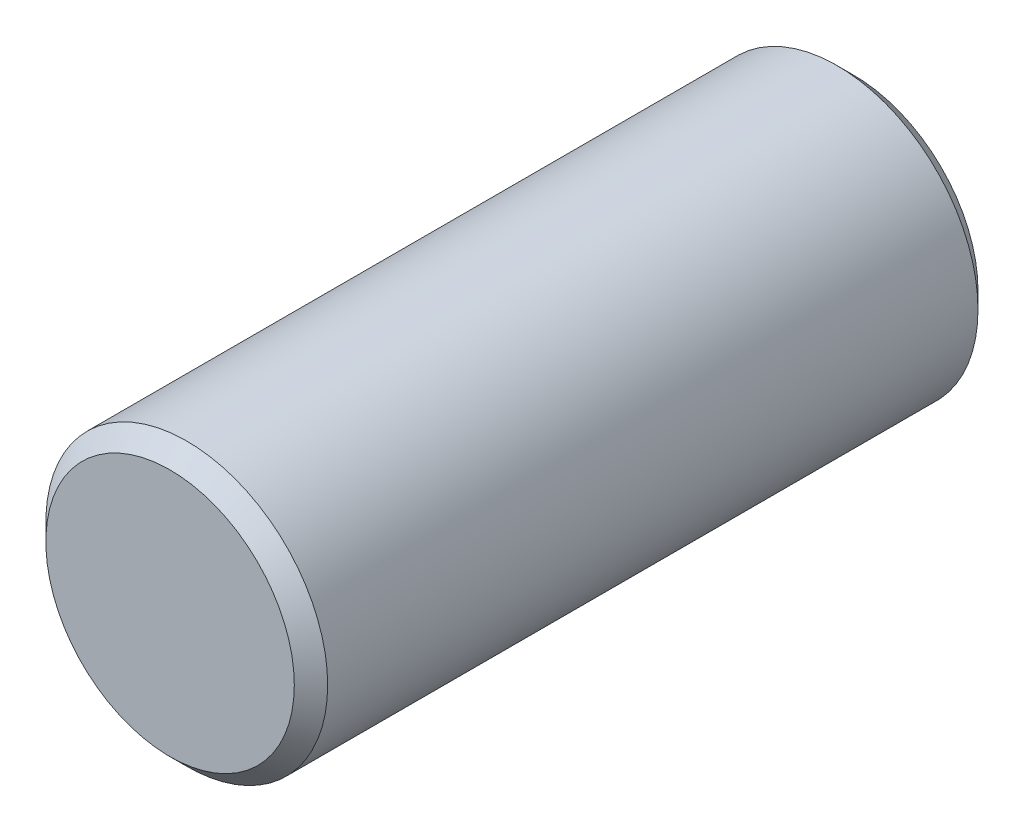
ISO-10303-21;
HEADER;
FILE_DESCRIPTION(('STEP AP214'),'2;1');
FILE_NAME('part.step','',(''),(''),'','','');
FILE_SCHEMA(('AUTOMOTIVE_DESIGN { 1 0 10303 214 1 1 1 1 }'));
ENDSEC;
DATA;
#1=APPLICATION_CONTEXT('core data for automotive mechanical design processes');
#2=APPLICATION_PROTOCOL_DEFINITION('international standard','automotive_design',2000,#1);
#3=PRODUCT_CONTEXT('',#1,'mechanical');
#4=PRODUCT('Part','Part','',(#3));
#5=PRODUCT_RELATED_PRODUCT_CATEGORY('part','',(#4));
#6=PRODUCT_DEFINITION_FORMATION('','',#4);
#7=PRODUCT_DEFINITION_CONTEXT('part definition',#1,'design');
#8=PRODUCT_DEFINITION('design','',#6,#7);
#9=PRODUCT_DEFINITION_SHAPE('','',#8);
#10=(LENGTH_UNIT() NAMED_UNIT(*) SI_UNIT(.MILLI.,.METRE.));
#11=(NAMED_UNIT(*) PLANE_ANGLE_UNIT() SI_UNIT($,.RADIAN.));
#12=(NAMED_UNIT(*) SI_UNIT($,.STERADIAN.) SOLID_ANGLE_UNIT());
#13=UNCERTAINTY_MEASURE_WITH_UNIT(LENGTH_MEASURE(1.E-05),#10,'distance_accuracy_value','');
#14=(GEOMETRIC_REPRESENTATION_CONTEXT(3) GLOBAL_UNCERTAINTY_ASSIGNED_CONTEXT((#13)) GLOBAL_UNIT_ASSIGNED_CONTEXT((#10,
#11,#12)) REPRESENTATION_CONTEXT('',''));
#15=CARTESIAN_POINT('',(0.,0.,0.));
#16=DIRECTION('',(0.,0.,1.));
#17=DIRECTION('',(1.,0.,0.));
#18=AXIS2_PLACEMENT_3D('',#15,#16,#17);
#19=CARTESIAN_POINT('',(0.,0.,1041.4));
#20=DIRECTION('',(0.,0.,-1.));
#21=DIRECTION('',(-1.,0.,0.));
#22=AXIS2_PLACEMENT_3D('',#19,#20,#21);
#23=CYLINDRICAL_SURFACE('',#22,429.26);
#24=CARTESIAN_POINT('',(0.,0.,990.6));
#25=DIRECTION('',(0.,0.,1.));
#26=DIRECTION('',(1.,0.,0.));
#27=AXIS2_PLACEMENT_3D('',#24,#25,#26);
#28=CIRCLE('',#27,429.26);
#29=CARTESIAN_POINT('',(429.26,0.,990.6));
#30=VERTEX_POINT('',#29);
#31=EDGE_CURVE('E50',#30,#30,#28,.F.);
#32=ORIENTED_EDGE('',*,*,#31,.T.);
#33=EDGE_LOOP('',(#32));
#34=FACE_BOUND('',#33,.T.);
#35=CARTESIAN_POINT('',(0.,0.,-990.6));
#36=DIRECTION('',(0.,0.,1.));
#37=DIRECTION('',(1.,0.,0.));
#38=AXIS2_PLACEMENT_3D('',#35,#36,#37);
#39=CIRCLE('',#38,429.26);
#40=CARTESIAN_POINT('',(429.26,0.,-990.6));
#41=VERTEX_POINT('',#40);
#42=EDGE_CURVE('E55',#41,#41,#39,.T.);
#43=ORIENTED_EDGE('',*,*,#42,.T.);
#44=EDGE_LOOP('',(#43));
#45=FACE_BOUND('',#44,.T.);
#46=ADVANCED_FACE('F41',(#34,#45),#23,.T.);
#47=CARTESIAN_POINT('',(0.,0.,1041.4));
#48=DIRECTION('',(0.,0.,1.));
#49=DIRECTION('',(1.,0.,0.));
#50=AXIS2_PLACEMENT_3D('',#47,#48,#49);
#51=PLANE('',#50);
#52=CARTESIAN_POINT('',(0.,0.,1041.4));
#53=DIRECTION('',(0.,0.,1.));
#54=DIRECTION('',(1.,0.,0.));
#55=AXIS2_PLACEMENT_3D('',#52,#53,#54);
#56=CIRCLE('',#55,378.46);
#57=CARTESIAN_POINT('',(378.46,0.,1041.4));
#58=VERTEX_POINT('',#57);
#59=EDGE_CURVE('E60',#58,#58,#56,.T.);
#60=ORIENTED_EDGE('',*,*,#59,.T.);
#61=EDGE_LOOP('',(#60));
#62=FACE_BOUND('',#61,.T.);
#63=ADVANCED_FACE('F67',(#62),#51,.T.);
#64=CARTESIAN_POINT('',(0.,0.,-1041.4));
#65=DIRECTION('',(0.,0.,1.));
#66=DIRECTION('',(1.,0.,0.));
#67=AXIS2_PLACEMENT_3D('',#64,#65,#66);
#68=PLANE('',#67);
#69=CARTESIAN_POINT('',(0.,0.,-1041.4));
#70=DIRECTION('',(0.,0.,1.));
#71=DIRECTION('',(1.,0.,0.));
#72=AXIS2_PLACEMENT_3D('',#69,#70,#71);
#73=CIRCLE('',#72,378.46);
#74=CARTESIAN_POINT('',(378.46,0.,-1041.4));
#75=VERTEX_POINT('',#74);
#76=EDGE_CURVE('E10',#75,#75,#73,.F.);
#77=ORIENTED_EDGE('',*,*,#76,.T.);
#78=EDGE_LOOP('',(#77));
#79=FACE_BOUND('',#78,.T.);
#80=ADVANCED_FACE('F71',(#79),#68,.F.);
#81=CARTESIAN_POINT('',(0.,0.,1041.4));
#82=DIRECTION('',(0.,0.,-1.));
#83=DIRECTION('',(-1.,0.,0.));
#84=AXIS2_PLACEMENT_3D('',#81,#82,#83);
#85=CONICAL_SURFACE('',#84,378.46,0.785398163397444);
#86=ORIENTED_EDGE('',*,*,#31,.F.);
#87=EDGE_LOOP('',(#86));
#88=FACE_BOUND('',#87,.T.);
#89=ORIENTED_EDGE('',*,*,#59,.F.);
#90=EDGE_LOOP('',(#89));
#91=FACE_BOUND('',#90,.T.);
#92=ADVANCED_FACE('F69',(#88,#91),#85,.T.);
#93=CARTESIAN_POINT('',(0.,0.,-990.6));
#94=DIRECTION('',(0.,0.,1.));
#95=DIRECTION('',(1.,0.,0.));
#96=AXIS2_PLACEMENT_3D('',#93,#94,#95);
#97=CONICAL_SURFACE('',#96,429.26,0.785398163397448);
#98=ORIENTED_EDGE('',*,*,#76,.F.);
#99=EDGE_LOOP('',(#98));
#100=FACE_BOUND('',#99,.T.);
#101=ORIENTED_EDGE('',*,*,#42,.F.);
#102=EDGE_LOOP('',(#101));
#103=FACE_BOUND('',#102,.T.);
#104=ADVANCED_FACE('F44',(#100,#103),#97,.T.);
#105=CLOSED_SHELL('',(#46,#63,#80,#92,#104));
#106=MANIFOLD_SOLID_BREP('B2',#105);
#107=ADVANCED_BREP_SHAPE_REPRESENTATION('',(#18,#106),#14);
#108=SHAPE_DEFINITION_REPRESENTATION(#9,#107);
ENDSEC;
END-ISO-10303-21;
